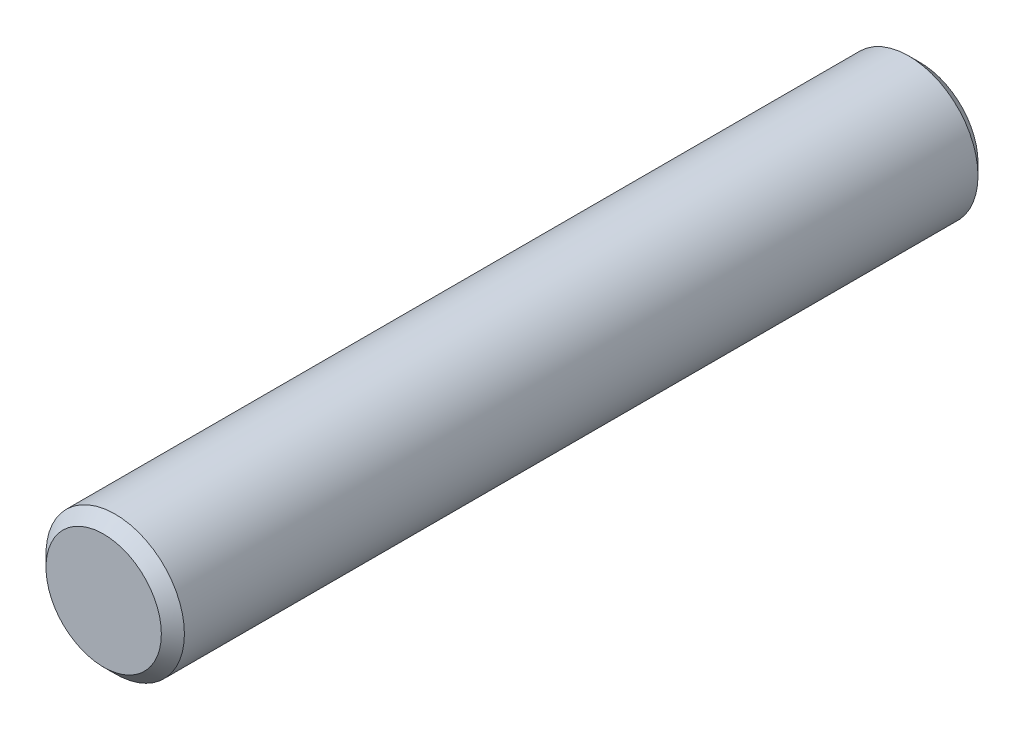
ISO-10303-21;
HEADER;
FILE_DESCRIPTION(('STEP AP214'),'2;1');
FILE_NAME('part.step','',(''),(''),'','','');
FILE_SCHEMA(('AUTOMOTIVE_DESIGN { 1 0 10303 214 1 1 1 1 }'));
ENDSEC;
DATA;
#1=APPLICATION_CONTEXT('core data for automotive mechanical design processes');
#2=APPLICATION_PROTOCOL_DEFINITION('international standard','automotive_design',2000,#1);
#3=PRODUCT_CONTEXT('',#1,'mechanical');
#4=PRODUCT('Part','Part','',(#3));
#5=PRODUCT_RELATED_PRODUCT_CATEGORY('part','',(#4));
#6=PRODUCT_DEFINITION_FORMATION('','',#4);
#7=PRODUCT_DEFINITION_CONTEXT('part definition',#1,'design');
#8=PRODUCT_DEFINITION('design','',#6,#7);
#9=PRODUCT_DEFINITION_SHAPE('','',#8);
#10=(LENGTH_UNIT() NAMED_UNIT(*) SI_UNIT(.MILLI.,.METRE.));
#11=(NAMED_UNIT(*) PLANE_ANGLE_UNIT() SI_UNIT($,.RADIAN.));
#12=(NAMED_UNIT(*) SI_UNIT($,.STERADIAN.) SOLID_ANGLE_UNIT());
#13=UNCERTAINTY_MEASURE_WITH_UNIT(LENGTH_MEASURE(1.E-05),#10,'distance_accuracy_value','');
#14=(GEOMETRIC_REPRESENTATION_CONTEXT(3) GLOBAL_UNCERTAINTY_ASSIGNED_CONTEXT((#13)) GLOBAL_UNIT_ASSIGNED_CONTEXT((#10,
#11,#12)) REPRESENTATION_CONTEXT('',''));
#15=CARTESIAN_POINT('',(0.,0.,0.));
#16=DIRECTION('',(0.,0.,1.));
#17=DIRECTION('',(1.,0.,0.));
#18=AXIS2_PLACEMENT_3D('',#15,#16,#17);
#19=CARTESIAN_POINT('',(0.,0.,56.2));
#20=DIRECTION('',(0.,0.,-1.));
#21=DIRECTION('',(-1.,0.,0.));
#22=AXIS2_PLACEMENT_3D('',#19,#20,#21);
#23=CYLINDRICAL_SURFACE('',#22,4.7625);
#24=CARTESIAN_POINT('',(0.,0.,0.79375000000001));
#25=DIRECTION('',(0.,0.,1.));
#26=DIRECTION('',(1.,0.,0.));
#27=AXIS2_PLACEMENT_3D('',#24,#25,#26);
#28=CIRCLE('',#27,4.7625);
#29=CARTESIAN_POINT('',(4.7625,0.,0.79375000000001));
#30=VERTEX_POINT('',#29);
#31=EDGE_CURVE('E53',#30,#30,#28,.T.);
#32=ORIENTED_EDGE('',*,*,#31,.T.);
#33=EDGE_LOOP('',(#32));
#34=FACE_BOUND('',#33,.T.);
#35=CARTESIAN_POINT('',(0.,0.,55.40625));
#36=DIRECTION('',(0.,0.,1.));
#37=DIRECTION('',(1.,0.,0.));
#38=AXIS2_PLACEMENT_3D('',#35,#36,#37);
#39=CIRCLE('',#38,4.7625);
#40=CARTESIAN_POINT('',(4.7625,0.,55.40625));
#41=VERTEX_POINT('',#40);
#42=EDGE_CURVE('E58',#41,#41,#39,.F.);
#43=ORIENTED_EDGE('',*,*,#42,.T.);
#44=EDGE_LOOP('',(#43));
#45=FACE_BOUND('',#44,.T.);
#46=ADVANCED_FACE('F39',(#34,#45),#23,.T.);
#47=CARTESIAN_POINT('',(0.,0.,56.2));
#48=DIRECTION('',(0.,0.,1.));
#49=DIRECTION('',(1.,0.,0.));
#50=AXIS2_PLACEMENT_3D('',#47,#48,#49);
#51=PLANE('',#50);
#52=CARTESIAN_POINT('',(0.,0.,56.2));
#53=DIRECTION('',(0.,0.,1.));
#54=DIRECTION('',(1.,0.,0.));
#55=AXIS2_PLACEMENT_3D('',#52,#53,#54);
#56=CIRCLE('',#55,3.96874999999999);
#57=CARTESIAN_POINT('',(3.96874999999999,0.,56.2));
#58=VERTEX_POINT('',#57);
#59=EDGE_CURVE('E10',#58,#58,#56,.T.);
#60=ORIENTED_EDGE('',*,*,#59,.T.);
#61=EDGE_LOOP('',(#60));
#62=FACE_BOUND('',#61,.T.);
#63=ADVANCED_FACE('F75',(#62),#51,.T.);
#64=CARTESIAN_POINT('',(0.,0.,0.));
#65=DIRECTION('',(0.,0.,1.));
#66=DIRECTION('',(1.,0.,0.));
#67=AXIS2_PLACEMENT_3D('',#64,#65,#66);
#68=PLANE('',#67);
#69=CARTESIAN_POINT('',(0.,0.,0.));
#70=DIRECTION('',(0.,0.,1.));
#71=DIRECTION('',(1.,0.,0.));
#72=AXIS2_PLACEMENT_3D('',#69,#70,#71);
#73=CIRCLE('',#72,3.96874999999999);
#74=CARTESIAN_POINT('',(3.96874999999999,0.,0.));
#75=VERTEX_POINT('',#74);
#76=EDGE_CURVE('E48',#75,#75,#73,.F.);
#77=ORIENTED_EDGE('',*,*,#76,.T.);
#78=EDGE_LOOP('',(#77));
#79=FACE_BOUND('',#78,.T.);
#80=ADVANCED_FACE('F72',(#79),#68,.F.);
#81=CARTESIAN_POINT('',(0.,0.,0.79375000000001));
#82=DIRECTION('',(0.,0.,1.));
#83=DIRECTION('',(1.,0.,0.));
#84=AXIS2_PLACEMENT_3D('',#81,#82,#83);
#85=CONICAL_SURFACE('',#84,4.7625,0.785398163397447);
#86=ORIENTED_EDGE('',*,*,#76,.F.);
#87=EDGE_LOOP('',(#86));
#88=FACE_BOUND('',#87,.T.);
#89=ORIENTED_EDGE('',*,*,#31,.F.);
#90=EDGE_LOOP('',(#89));
#91=FACE_BOUND('',#90,.T.);
#92=ADVANCED_FACE('F68',(#88,#91),#85,.T.);
#93=CARTESIAN_POINT('',(0.,0.,56.2));
#94=DIRECTION('',(0.,0.,-1.));
#95=DIRECTION('',(-1.,0.,0.));
#96=AXIS2_PLACEMENT_3D('',#93,#94,#95);
#97=CONICAL_SURFACE('',#96,3.96874999999999,0.785398163397447);
#98=ORIENTED_EDGE('',*,*,#42,.F.);
#99=EDGE_LOOP('',(#98));
#100=FACE_BOUND('',#99,.T.);
#101=ORIENTED_EDGE('',*,*,#59,.F.);
#102=EDGE_LOOP('',(#101));
#103=FACE_BOUND('',#102,.T.);
#104=ADVANCED_FACE('F42',(#100,#103),#97,.T.);
#105=CLOSED_SHELL('',(#46,#63,#80,#92,#104));
#106=MANIFOLD_SOLID_BREP('B2',#105);
#107=ADVANCED_BREP_SHAPE_REPRESENTATION('',(#18,#106),#14);
#108=SHAPE_DEFINITION_REPRESENTATION(#9,#107);
ENDSEC;
END-ISO-10303-21;
